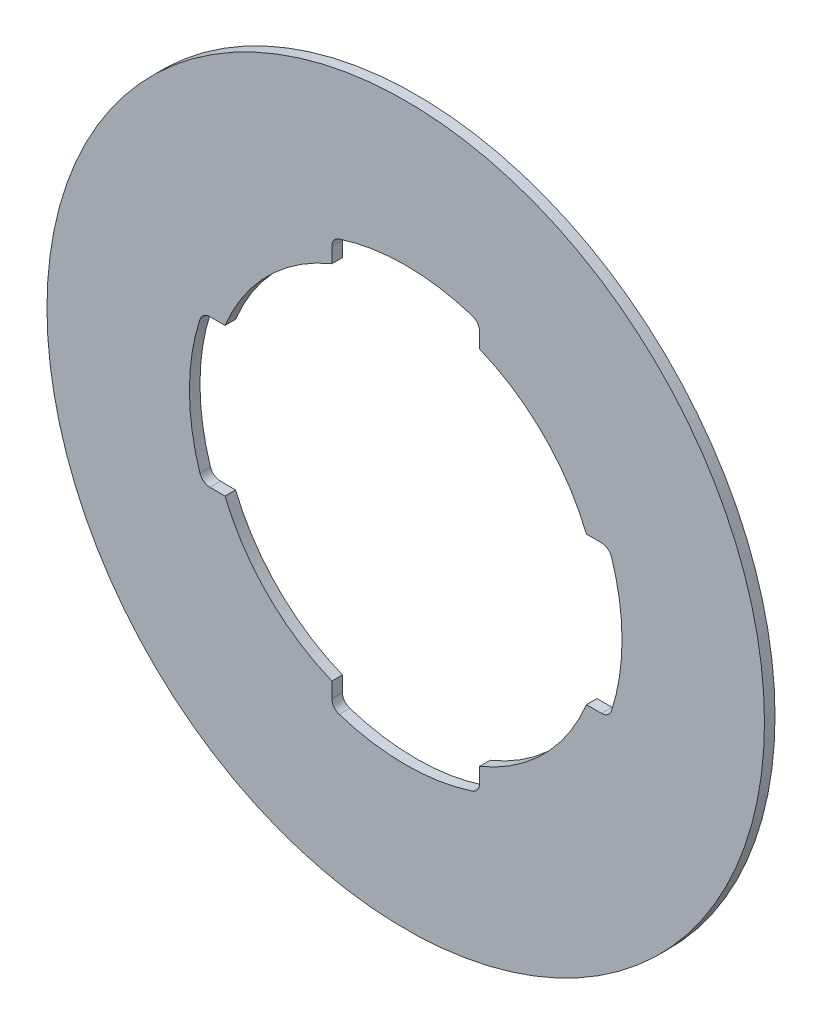
ISO-10303-21;
HEADER;
FILE_DESCRIPTION(('STEP AP214'),'2;1');
FILE_NAME('part.step','',(''),(''),'','','');
FILE_SCHEMA(('AUTOMOTIVE_DESIGN { 1 0 10303 214 1 1 1 1 }'));
ENDSEC;
DATA;
#1=APPLICATION_CONTEXT('core data for automotive mechanical design processes');
#2=APPLICATION_PROTOCOL_DEFINITION('international standard','automotive_design',2000,#1);
#3=PRODUCT_CONTEXT('',#1,'mechanical');
#4=PRODUCT('Part','Part','',(#3));
#5=PRODUCT_RELATED_PRODUCT_CATEGORY('part','',(#4));
#6=PRODUCT_DEFINITION_FORMATION('','',#4);
#7=PRODUCT_DEFINITION_CONTEXT('part definition',#1,'design');
#8=PRODUCT_DEFINITION('design','',#6,#7);
#9=PRODUCT_DEFINITION_SHAPE('','',#8);
#10=(LENGTH_UNIT() NAMED_UNIT(*) SI_UNIT(.MILLI.,.METRE.));
#11=(NAMED_UNIT(*) PLANE_ANGLE_UNIT() SI_UNIT($,.RADIAN.));
#12=(NAMED_UNIT(*) SI_UNIT($,.STERADIAN.) SOLID_ANGLE_UNIT());
#13=UNCERTAINTY_MEASURE_WITH_UNIT(LENGTH_MEASURE(1.E-05),#10,'distance_accuracy_value','');
#14=(GEOMETRIC_REPRESENTATION_CONTEXT(3) GLOBAL_UNCERTAINTY_ASSIGNED_CONTEXT((#13)) GLOBAL_UNIT_ASSIGNED_CONTEXT((#10,
#11,#12)) REPRESENTATION_CONTEXT('',''));
#15=CARTESIAN_POINT('',(0.,0.,0.));
#16=DIRECTION('',(0.,0.,1.));
#17=DIRECTION('',(1.,0.,0.));
#18=AXIS2_PLACEMENT_3D('',#15,#16,#17);
#19=CARTESIAN_POINT('',(0.,0.,0.));
#20=DIRECTION('',(0.,0.,1.));
#21=DIRECTION('',(1.,0.,0.));
#22=AXIS2_PLACEMENT_3D('',#19,#20,#21);
#23=PLANE('',#22);
#24=CARTESIAN_POINT('',(0.,0.,0.));
#25=DIRECTION('',(0.,0.,1.));
#26=DIRECTION('',(-1.,0.,0.));
#27=AXIS2_PLACEMENT_3D('',#24,#25,#26);
#28=CIRCLE('',#27,17.);
#29=CARTESIAN_POINT('',(-17.,0.,0.));
#30=VERTEX_POINT('',#29);
#31=EDGE_CURVE('E294',#30,#30,#28,.T.);
#32=ORIENTED_EDGE('',*,*,#31,.F.);
#33=EDGE_LOOP('',(#32));
#34=FACE_BOUND('',#33,.T.);
#35=CARTESIAN_POINT('',(-3.,9.27698765764,0.));
#36=DIRECTION('',(0.,0.,1.));
#37=DIRECTION('',(-0.307692307692293,0.95148591360408,0.));
#38=AXIS2_PLACEMENT_3D('',#35,#36,#37);
#39=CIRCLE('',#38,0.5);
#40=CARTESIAN_POINT('',(-3.153846153846,9.752730614442,0.));
#41=VERTEX_POINT('',#40);
#42=CARTESIAN_POINT('',(-3.5,9.27698765764,0.));
#43=VERTEX_POINT('',#42);
#44=EDGE_CURVE('E11',#41,#43,#39,.T.);
#45=ORIENTED_EDGE('',*,*,#44,.T.);
#46=DIRECTION('',(0.,1.,0.));
#47=VECTOR('',#46,1.);
#48=CARTESIAN_POINT('',(-3.5,8.562271894772,0.));
#49=LINE('',#48,#47);
#50=CARTESIAN_POINT('',(-3.5,8.562271894772,0.));
#51=VERTEX_POINT('',#50);
#52=EDGE_CURVE('E36',#51,#43,#49,.T.);
#53=ORIENTED_EDGE('',*,*,#52,.F.);
#54=CARTESIAN_POINT('',(0.,0.,0.));
#55=DIRECTION('',(0.,0.,-1.));
#56=DIRECTION('',(-0.925651015651002,0.378378378378401,0.));
#57=AXIS2_PLACEMENT_3D('',#54,#55,#56);
#58=CIRCLE('',#57,9.25);
#59=CARTESIAN_POINT('',(-8.562271894772,3.5,0.));
#60=VERTEX_POINT('',#59);
#61=EDGE_CURVE('E214',#60,#51,#58,.T.);
#62=ORIENTED_EDGE('',*,*,#61,.F.);
#63=DIRECTION('',(1.,0.,0.));
#64=VECTOR('',#63,1.);
#65=CARTESIAN_POINT('',(-9.27698765764,3.5,0.));
#66=LINE('',#65,#64);
#67=CARTESIAN_POINT('',(-9.27698765764,3.5,0.));
#68=VERTEX_POINT('',#67);
#69=EDGE_CURVE('E222',#68,#60,#66,.T.);
#70=ORIENTED_EDGE('',*,*,#69,.F.);
#71=CARTESIAN_POINT('',(-9.27698765764,3.,0.));
#72=DIRECTION('',(0.,0.,1.));
#73=DIRECTION('',(0.,1.,0.));
#74=AXIS2_PLACEMENT_3D('',#71,#72,#73);
#75=CIRCLE('',#74,0.5);
#76=CARTESIAN_POINT('',(-9.752730614442,3.153846153846,0.));
#77=VERTEX_POINT('',#76);
#78=EDGE_CURVE('E27',#68,#77,#75,.T.);
#79=ORIENTED_EDGE('',*,*,#78,.T.);
#80=CARTESIAN_POINT('',(0.,0.,0.));
#81=DIRECTION('',(0.,0.,-1.));
#82=DIRECTION('',(-0.95148591360408,-0.307692307692293,0.));
#83=AXIS2_PLACEMENT_3D('',#80,#81,#82);
#84=CIRCLE('',#83,10.25);
#85=CARTESIAN_POINT('',(-9.752730614442,-3.153846153846,0.));
#86=VERTEX_POINT('',#85);
#87=EDGE_CURVE('E229',#86,#77,#84,.T.);
#88=ORIENTED_EDGE('',*,*,#87,.F.);
#89=CARTESIAN_POINT('',(-9.27698765764,-3.,0.));
#90=DIRECTION('',(0.,0.,1.));
#91=DIRECTION('',(-0.95148591360408,-0.307692307692293,0.));
#92=AXIS2_PLACEMENT_3D('',#89,#90,#91);
#93=CIRCLE('',#92,0.5);
#94=CARTESIAN_POINT('',(-9.27698765764,-3.5,0.));
#95=VERTEX_POINT('',#94);
#96=EDGE_CURVE('E423',#86,#95,#93,.T.);
#97=ORIENTED_EDGE('',*,*,#96,.T.);
#98=DIRECTION('',(-1.,0.,0.));
#99=VECTOR('',#98,1.);
#100=CARTESIAN_POINT('',(-8.562271894772,-3.5,0.));
#101=LINE('',#100,#99);
#102=CARTESIAN_POINT('',(-8.562271894772,-3.5,0.));
#103=VERTEX_POINT('',#102);
#104=EDGE_CURVE('E236',#103,#95,#101,.T.);
#105=ORIENTED_EDGE('',*,*,#104,.F.);
#106=CARTESIAN_POINT('',(0.,0.,0.));
#107=DIRECTION('',(0.,0.,-1.));
#108=DIRECTION('',(-0.378378378378401,-0.925651015651002,0.));
#109=AXIS2_PLACEMENT_3D('',#106,#107,#108);
#110=CIRCLE('',#109,9.25);
#111=CARTESIAN_POINT('',(-3.5,-8.562271894772,0.));
#112=VERTEX_POINT('',#111);
#113=EDGE_CURVE('E244',#112,#103,#110,.T.);
#114=ORIENTED_EDGE('',*,*,#113,.F.);
#115=DIRECTION('',(0.,1.,0.));
#116=VECTOR('',#115,1.);
#117=CARTESIAN_POINT('',(-3.5,-9.27698765764,0.));
#118=LINE('',#117,#116);
#119=CARTESIAN_POINT('',(-3.5,-9.27698765764,0.));
#120=VERTEX_POINT('',#119);
#121=EDGE_CURVE('E257',#120,#112,#118,.T.);
#122=ORIENTED_EDGE('',*,*,#121,.F.);
#123=CARTESIAN_POINT('',(-3.,-9.27698765764,0.));
#124=DIRECTION('',(0.,0.,1.));
#125=DIRECTION('',(-1.,0.,0.));
#126=AXIS2_PLACEMENT_3D('',#123,#124,#125);
#127=CIRCLE('',#126,0.5);
#128=CARTESIAN_POINT('',(-3.153846153846,-9.752730614442,0.));
#129=VERTEX_POINT('',#128);
#130=EDGE_CURVE('E407',#120,#129,#127,.T.);
#131=ORIENTED_EDGE('',*,*,#130,.T.);
#132=CARTESIAN_POINT('',(0.,0.,0.));
#133=DIRECTION('',(0.,0.,-1.));
#134=DIRECTION('',(0.307692307692293,-0.95148591360408,0.));
#135=AXIS2_PLACEMENT_3D('',#132,#133,#134);
#136=CIRCLE('',#135,10.25);
#137=CARTESIAN_POINT('',(3.153846153846,-9.752730614442,0.));
#138=VERTEX_POINT('',#137);
#139=EDGE_CURVE('E264',#138,#129,#136,.T.);
#140=ORIENTED_EDGE('',*,*,#139,.F.);
#141=CARTESIAN_POINT('',(3.,-9.27698765764,0.));
#142=DIRECTION('',(0.,0.,1.));
#143=DIRECTION('',(0.307692307692293,-0.95148591360408,0.));
#144=AXIS2_PLACEMENT_3D('',#141,#142,#143);
#145=CIRCLE('',#144,0.5);
#146=CARTESIAN_POINT('',(3.5,-9.27698765764,0.));
#147=VERTEX_POINT('',#146);
#148=EDGE_CURVE('E397',#138,#147,#145,.T.);
#149=ORIENTED_EDGE('',*,*,#148,.T.);
#150=DIRECTION('',(0.,-1.,0.));
#151=VECTOR('',#150,1.);
#152=CARTESIAN_POINT('',(3.5,-8.562271894772,0.));
#153=LINE('',#152,#151);
#154=CARTESIAN_POINT('',(3.5,-8.562271894772,0.));
#155=VERTEX_POINT('',#154);
#156=EDGE_CURVE('E245',#155,#147,#153,.T.);
#157=ORIENTED_EDGE('',*,*,#156,.F.);
#158=CARTESIAN_POINT('',(0.,0.,0.));
#159=DIRECTION('',(0.,0.,-1.));
#160=DIRECTION('',(0.925651015651002,-0.378378378378401,0.));
#161=AXIS2_PLACEMENT_3D('',#158,#159,#160);
#162=CIRCLE('',#161,9.25);
#163=CARTESIAN_POINT('',(8.562271894772,-3.5,0.));
#164=VERTEX_POINT('',#163);
#165=EDGE_CURVE('E240',#164,#155,#162,.T.);
#166=ORIENTED_EDGE('',*,*,#165,.F.);
#167=DIRECTION('',(-1.,0.,0.));
#168=VECTOR('',#167,1.);
#169=CARTESIAN_POINT('',(9.27698765764,-3.5,0.));
#170=LINE('',#169,#168);
#171=CARTESIAN_POINT('',(9.27698765764,-3.5,0.));
#172=VERTEX_POINT('',#171);
#173=EDGE_CURVE('E249',#172,#164,#170,.T.);
#174=ORIENTED_EDGE('',*,*,#173,.F.);
#175=CARTESIAN_POINT('',(9.27698765764,-3.,0.));
#176=DIRECTION('',(0.,0.,1.));
#177=DIRECTION('',(0.,-1.,0.));
#178=AXIS2_PLACEMENT_3D('',#175,#176,#177);
#179=CIRCLE('',#178,0.5);
#180=CARTESIAN_POINT('',(9.752730614442,-3.153846153846,0.));
#181=VERTEX_POINT('',#180);
#182=EDGE_CURVE('E373',#172,#181,#179,.T.);
#183=ORIENTED_EDGE('',*,*,#182,.T.);
#184=CARTESIAN_POINT('',(0.,0.,0.));
#185=DIRECTION('',(0.,0.,-1.));
#186=DIRECTION('',(0.95148591360408,0.307692307692293,0.));
#187=AXIS2_PLACEMENT_3D('',#184,#185,#186);
#188=CIRCLE('',#187,10.25);
#189=CARTESIAN_POINT('',(9.752730614442,3.153846153846,0.));
#190=VERTEX_POINT('',#189);
#191=EDGE_CURVE('E273',#190,#181,#188,.T.);
#192=ORIENTED_EDGE('',*,*,#191,.F.);
#193=CARTESIAN_POINT('',(9.27698765764,3.,0.));
#194=DIRECTION('',(0.,0.,1.));
#195=DIRECTION('',(0.95148591360408,0.307692307692293,0.));
#196=AXIS2_PLACEMENT_3D('',#193,#194,#195);
#197=CIRCLE('',#196,0.5);
#198=CARTESIAN_POINT('',(9.27698765764,3.5,0.));
#199=VERTEX_POINT('',#198);
#200=EDGE_CURVE('E289',#190,#199,#197,.T.);
#201=ORIENTED_EDGE('',*,*,#200,.T.);
#202=DIRECTION('',(1.,0.,0.));
#203=VECTOR('',#202,1.);
#204=CARTESIAN_POINT('',(8.562271894772,3.5,0.));
#205=LINE('',#204,#203);
#206=CARTESIAN_POINT('',(8.562271894772,3.5,0.));
#207=VERTEX_POINT('',#206);
#208=EDGE_CURVE('E278',#207,#199,#205,.T.);
#209=ORIENTED_EDGE('',*,*,#208,.F.);
#210=CARTESIAN_POINT('',(0.,0.,0.));
#211=DIRECTION('',(0.,0.,-1.));
#212=DIRECTION('',(0.378378378378401,0.925651015651002,0.));
#213=AXIS2_PLACEMENT_3D('',#210,#211,#212);
#214=CIRCLE('',#213,9.25);
#215=CARTESIAN_POINT('',(3.5,8.562271894772,0.));
#216=VERTEX_POINT('',#215);
#217=EDGE_CURVE('E218',#216,#207,#214,.T.);
#218=ORIENTED_EDGE('',*,*,#217,.F.);
#219=DIRECTION('',(0.,-1.,0.));
#220=VECTOR('',#219,1.);
#221=CARTESIAN_POINT('',(3.5,9.27698765764,0.));
#222=LINE('',#221,#220);
#223=CARTESIAN_POINT('',(3.5,9.27698765764,0.));
#224=VERTEX_POINT('',#223);
#225=EDGE_CURVE('E191',#224,#216,#222,.T.);
#226=ORIENTED_EDGE('',*,*,#225,.F.);
#227=CARTESIAN_POINT('',(3.,9.27698765764,0.));
#228=DIRECTION('',(0.,0.,1.));
#229=DIRECTION('',(1.,0.,0.));
#230=AXIS2_PLACEMENT_3D('',#227,#228,#229);
#231=CIRCLE('',#230,0.5);
#232=CARTESIAN_POINT('',(3.153846153846,9.752730614442,0.));
#233=VERTEX_POINT('',#232);
#234=EDGE_CURVE('E201',#224,#233,#231,.T.);
#235=ORIENTED_EDGE('',*,*,#234,.T.);
#236=CARTESIAN_POINT('',(0.,0.,0.));
#237=DIRECTION('',(0.,0.,-1.));
#238=DIRECTION('',(-0.307692307692293,0.95148591360408,0.));
#239=AXIS2_PLACEMENT_3D('',#236,#237,#238);
#240=CIRCLE('',#239,10.25);
#241=EDGE_CURVE('E202',#41,#233,#240,.T.);
#242=ORIENTED_EDGE('',*,*,#241,.F.);
#243=EDGE_LOOP('',(#45,#53,#62,#70,#79,#88,#97,#105,#114,#122,#131,#140,#149,#157,#166,#174,
#183,#192,#201,#209,#218,#226,#235,#242));
#244=FACE_BOUND('',#243,.T.);
#245=ADVANCED_FACE('F17',(#34,#244),#23,.F.);
#246=CARTESIAN_POINT('',(0.,0.,0.));
#247=DIRECTION('',(0.,0.,1.));
#248=DIRECTION('',(1.,0.,0.));
#249=AXIS2_PLACEMENT_3D('',#246,#247,#248);
#250=CYLINDRICAL_SURFACE('',#249,17.);
#251=CARTESIAN_POINT('',(0.,0.,0.5));
#252=DIRECTION('',(0.,0.,1.));
#253=DIRECTION('',(1.,0.,0.));
#254=AXIS2_PLACEMENT_3D('',#251,#252,#253);
#255=CIRCLE('',#254,17.);
#256=CARTESIAN_POINT('',(17.,0.,0.5));
#257=VERTEX_POINT('',#256);
#258=EDGE_CURVE('E296',#257,#257,#255,.T.);
#259=ORIENTED_EDGE('',*,*,#258,.F.);
#260=EDGE_LOOP('',(#259));
#261=FACE_BOUND('',#260,.T.);
#262=ORIENTED_EDGE('',*,*,#31,.T.);
#263=EDGE_LOOP('',(#262));
#264=FACE_BOUND('',#263,.T.);
#265=ADVANCED_FACE('F451',(#261,#264),#250,.T.);
#266=CARTESIAN_POINT('',(0.,0.,0.5));
#267=DIRECTION('',(0.,0.,1.));
#268=DIRECTION('',(1.,0.,0.));
#269=AXIS2_PLACEMENT_3D('',#266,#267,#268);
#270=PLANE('',#269);
#271=ORIENTED_EDGE('',*,*,#258,.T.);
#272=EDGE_LOOP('',(#271));
#273=FACE_BOUND('',#272,.T.);
#274=CARTESIAN_POINT('',(0.,0.,0.5));
#275=DIRECTION('',(0.,0.,-1.));
#276=DIRECTION('',(0.378378378378401,0.925651015651002,0.));
#277=AXIS2_PLACEMENT_3D('',#274,#275,#276);
#278=CIRCLE('',#277,9.25);
#279=CARTESIAN_POINT('',(3.5,8.562271894772,0.5));
#280=VERTEX_POINT('',#279);
#281=CARTESIAN_POINT('',(8.562271894772,3.5,0.5));
#282=VERTEX_POINT('',#281);
#283=EDGE_CURVE('E299',#280,#282,#278,.T.);
#284=ORIENTED_EDGE('',*,*,#283,.T.);
#285=DIRECTION('',(1.,0.,0.));
#286=VECTOR('',#285,1.);
#287=CARTESIAN_POINT('',(8.562271894772,3.5,0.5));
#288=LINE('',#287,#286);
#289=CARTESIAN_POINT('',(9.27698765764,3.5,0.5));
#290=VERTEX_POINT('',#289);
#291=EDGE_CURVE('E301',#282,#290,#288,.T.);
#292=ORIENTED_EDGE('',*,*,#291,.T.);
#293=CARTESIAN_POINT('',(9.27698765764,3.,0.5));
#294=DIRECTION('',(0.,0.,-1.));
#295=DIRECTION('',(0.,1.,0.));
#296=AXIS2_PLACEMENT_3D('',#293,#294,#295);
#297=CIRCLE('',#296,0.5);
#298=CARTESIAN_POINT('',(9.752730614442,3.153846153846,0.5));
#299=VERTEX_POINT('',#298);
#300=EDGE_CURVE('E304',#290,#299,#297,.T.);
#301=ORIENTED_EDGE('',*,*,#300,.T.);
#302=CARTESIAN_POINT('',(0.,0.,0.5));
#303=DIRECTION('',(0.,0.,-1.));
#304=DIRECTION('',(0.95148591360408,0.307692307692293,0.));
#305=AXIS2_PLACEMENT_3D('',#302,#303,#304);
#306=CIRCLE('',#305,10.25);
#307=CARTESIAN_POINT('',(9.752730614442,-3.153846153846,0.5));
#308=VERTEX_POINT('',#307);
#309=EDGE_CURVE('E307',#299,#308,#306,.T.);
#310=ORIENTED_EDGE('',*,*,#309,.T.);
#311=CARTESIAN_POINT('',(9.27698765764,-3.,0.5));
#312=DIRECTION('',(0.,0.,-1.));
#313=DIRECTION('',(0.95148591360408,-0.307692307692293,0.));
#314=AXIS2_PLACEMENT_3D('',#311,#312,#313);
#315=CIRCLE('',#314,0.5);
#316=CARTESIAN_POINT('',(9.27698765764,-3.5,0.5));
#317=VERTEX_POINT('',#316);
#318=EDGE_CURVE('E310',#308,#317,#315,.T.);
#319=ORIENTED_EDGE('',*,*,#318,.T.);
#320=DIRECTION('',(-1.,0.,0.));
#321=VECTOR('',#320,1.);
#322=CARTESIAN_POINT('',(9.27698765764,-3.5,0.5));
#323=LINE('',#322,#321);
#324=CARTESIAN_POINT('',(8.562271894772,-3.5,0.5));
#325=VERTEX_POINT('',#324);
#326=EDGE_CURVE('E313',#317,#325,#323,.T.);
#327=ORIENTED_EDGE('',*,*,#326,.T.);
#328=CARTESIAN_POINT('',(0.,0.,0.5));
#329=DIRECTION('',(0.,0.,-1.));
#330=DIRECTION('',(0.925651015651002,-0.378378378378401,0.));
#331=AXIS2_PLACEMENT_3D('',#328,#329,#330);
#332=CIRCLE('',#331,9.25);
#333=CARTESIAN_POINT('',(3.5,-8.562271894772,0.5));
#334=VERTEX_POINT('',#333);
#335=EDGE_CURVE('E316',#325,#334,#332,.T.);
#336=ORIENTED_EDGE('',*,*,#335,.T.);
#337=DIRECTION('',(0.,-1.,0.));
#338=VECTOR('',#337,1.);
#339=CARTESIAN_POINT('',(3.5,-8.562271894772,0.5));
#340=LINE('',#339,#338);
#341=CARTESIAN_POINT('',(3.5,-9.27698765764,0.5));
#342=VERTEX_POINT('',#341);
#343=EDGE_CURVE('E319',#334,#342,#340,.T.);
#344=ORIENTED_EDGE('',*,*,#343,.T.);
#345=CARTESIAN_POINT('',(3.,-9.27698765764,0.5));
#346=DIRECTION('',(0.,0.,-1.));
#347=DIRECTION('',(1.,0.,0.));
#348=AXIS2_PLACEMENT_3D('',#345,#346,#347);
#349=CIRCLE('',#348,0.5);
#350=CARTESIAN_POINT('',(3.153846153846,-9.752730614442,0.5));
#351=VERTEX_POINT('',#350);
#352=EDGE_CURVE('E322',#342,#351,#349,.T.);
#353=ORIENTED_EDGE('',*,*,#352,.T.);
#354=CARTESIAN_POINT('',(0.,0.,0.5));
#355=DIRECTION('',(0.,0.,-1.));
#356=DIRECTION('',(0.307692307692293,-0.95148591360408,0.));
#357=AXIS2_PLACEMENT_3D('',#354,#355,#356);
#358=CIRCLE('',#357,10.25);
#359=CARTESIAN_POINT('',(-3.153846153846,-9.752730614442,0.5));
#360=VERTEX_POINT('',#359);
#361=EDGE_CURVE('E325',#351,#360,#358,.T.);
#362=ORIENTED_EDGE('',*,*,#361,.T.);
#363=CARTESIAN_POINT('',(-3.,-9.27698765764,0.5));
#364=DIRECTION('',(0.,0.,-1.));
#365=DIRECTION('',(-0.307692307692293,-0.95148591360408,0.));
#366=AXIS2_PLACEMENT_3D('',#363,#364,#365);
#367=CIRCLE('',#366,0.5);
#368=CARTESIAN_POINT('',(-3.5,-9.27698765764,0.5));
#369=VERTEX_POINT('',#368);
#370=EDGE_CURVE('E328',#360,#369,#367,.T.);
#371=ORIENTED_EDGE('',*,*,#370,.T.);
#372=DIRECTION('',(0.,1.,0.));
#373=VECTOR('',#372,1.);
#374=CARTESIAN_POINT('',(-3.5,-9.27698765764,0.5));
#375=LINE('',#374,#373);
#376=CARTESIAN_POINT('',(-3.5,-8.562271894772,0.5));
#377=VERTEX_POINT('',#376);
#378=EDGE_CURVE('E331',#369,#377,#375,.T.);
#379=ORIENTED_EDGE('',*,*,#378,.T.);
#380=CARTESIAN_POINT('',(0.,0.,0.5));
#381=DIRECTION('',(0.,0.,-1.));
#382=DIRECTION('',(-0.378378378378401,-0.925651015651002,0.));
#383=AXIS2_PLACEMENT_3D('',#380,#381,#382);
#384=CIRCLE('',#383,9.25);
#385=CARTESIAN_POINT('',(-8.562271894772,-3.5,0.5));
#386=VERTEX_POINT('',#385);
#387=EDGE_CURVE('E334',#377,#386,#384,.T.);
#388=ORIENTED_EDGE('',*,*,#387,.T.);
#389=DIRECTION('',(-1.,0.,0.));
#390=VECTOR('',#389,1.);
#391=CARTESIAN_POINT('',(-8.562271894772,-3.5,0.5));
#392=LINE('',#391,#390);
#393=CARTESIAN_POINT('',(-9.27698765764,-3.5,0.5));
#394=VERTEX_POINT('',#393);
#395=EDGE_CURVE('E337',#386,#394,#392,.T.);
#396=ORIENTED_EDGE('',*,*,#395,.T.);
#397=CARTESIAN_POINT('',(-9.27698765764,-3.,0.5));
#398=DIRECTION('',(0.,0.,-1.));
#399=DIRECTION('',(0.,-1.,0.));
#400=AXIS2_PLACEMENT_3D('',#397,#398,#399);
#401=CIRCLE('',#400,0.5);
#402=CARTESIAN_POINT('',(-9.752730614442,-3.153846153846,0.5));
#403=VERTEX_POINT('',#402);
#404=EDGE_CURVE('E340',#394,#403,#401,.T.);
#405=ORIENTED_EDGE('',*,*,#404,.T.);
#406=CARTESIAN_POINT('',(0.,0.,0.5));
#407=DIRECTION('',(0.,0.,-1.));
#408=DIRECTION('',(-0.95148591360408,-0.307692307692293,0.));
#409=AXIS2_PLACEMENT_3D('',#406,#407,#408);
#410=CIRCLE('',#409,10.25);
#411=CARTESIAN_POINT('',(-9.752730614442,3.153846153846,0.5));
#412=VERTEX_POINT('',#411);
#413=EDGE_CURVE('E343',#403,#412,#410,.T.);
#414=ORIENTED_EDGE('',*,*,#413,.T.);
#415=CARTESIAN_POINT('',(-9.27698765764,3.,0.5));
#416=DIRECTION('',(0.,0.,-1.));
#417=DIRECTION('',(-0.95148591360408,0.307692307692293,0.));
#418=AXIS2_PLACEMENT_3D('',#415,#416,#417);
#419=CIRCLE('',#418,0.5);
#420=CARTESIAN_POINT('',(-9.27698765764,3.5,0.5));
#421=VERTEX_POINT('',#420);
#422=EDGE_CURVE('E346',#412,#421,#419,.T.);
#423=ORIENTED_EDGE('',*,*,#422,.T.);
#424=DIRECTION('',(1.,0.,0.));
#425=VECTOR('',#424,1.);
#426=CARTESIAN_POINT('',(-9.27698765764,3.5,0.5));
#427=LINE('',#426,#425);
#428=CARTESIAN_POINT('',(-8.562271894772,3.5,0.5));
#429=VERTEX_POINT('',#428);
#430=EDGE_CURVE('E349',#421,#429,#427,.T.);
#431=ORIENTED_EDGE('',*,*,#430,.T.);
#432=CARTESIAN_POINT('',(0.,0.,0.5));
#433=DIRECTION('',(0.,0.,-1.));
#434=DIRECTION('',(-0.925651015651002,0.378378378378401,0.));
#435=AXIS2_PLACEMENT_3D('',#432,#433,#434);
#436=CIRCLE('',#435,9.25);
#437=CARTESIAN_POINT('',(-3.5,8.562271894772,0.5));
#438=VERTEX_POINT('',#437);
#439=EDGE_CURVE('E352',#429,#438,#436,.T.);
#440=ORIENTED_EDGE('',*,*,#439,.T.);
#441=DIRECTION('',(0.,1.,0.));
#442=VECTOR('',#441,1.);
#443=CARTESIAN_POINT('',(-3.5,8.562271894772,0.5));
#444=LINE('',#443,#442);
#445=CARTESIAN_POINT('',(-3.5,9.27698765764,0.5));
#446=VERTEX_POINT('',#445);
#447=EDGE_CURVE('E355',#438,#446,#444,.T.);
#448=ORIENTED_EDGE('',*,*,#447,.T.);
#449=CARTESIAN_POINT('',(-3.,9.27698765764,0.5));
#450=DIRECTION('',(0.,0.,-1.));
#451=DIRECTION('',(-1.,0.,0.));
#452=AXIS2_PLACEMENT_3D('',#449,#450,#451);
#453=CIRCLE('',#452,0.5);
#454=CARTESIAN_POINT('',(-3.153846153846,9.752730614442,0.5));
#455=VERTEX_POINT('',#454);
#456=EDGE_CURVE('E358',#446,#455,#453,.T.);
#457=ORIENTED_EDGE('',*,*,#456,.T.);
#458=CARTESIAN_POINT('',(0.,0.,0.5));
#459=DIRECTION('',(0.,0.,-1.));
#460=DIRECTION('',(-0.307692307692293,0.95148591360408,0.));
#461=AXIS2_PLACEMENT_3D('',#458,#459,#460);
#462=CIRCLE('',#461,10.25);
#463=CARTESIAN_POINT('',(3.153846153846,9.752730614442,0.5));
#464=VERTEX_POINT('',#463);
#465=EDGE_CURVE('E195',#455,#464,#462,.T.);
#466=ORIENTED_EDGE('',*,*,#465,.T.);
#467=CARTESIAN_POINT('',(3.,9.27698765764,0.5));
#468=DIRECTION('',(0.,0.,-1.));
#469=DIRECTION('',(0.307692307692293,0.95148591360408,0.));
#470=AXIS2_PLACEMENT_3D('',#467,#468,#469);
#471=CIRCLE('',#470,0.5);
#472=CARTESIAN_POINT('',(3.5,9.27698765764,0.5));
#473=VERTEX_POINT('',#472);
#474=EDGE_CURVE('E176',#464,#473,#471,.T.);
#475=ORIENTED_EDGE('',*,*,#474,.T.);
#476=DIRECTION('',(0.,-1.,0.));
#477=VECTOR('',#476,1.);
#478=CARTESIAN_POINT('',(3.5,9.27698765764,0.5));
#479=LINE('',#478,#477);
#480=EDGE_CURVE('E182',#473,#280,#479,.T.);
#481=ORIENTED_EDGE('',*,*,#480,.T.);
#482=EDGE_LOOP('',(#284,#292,#301,#310,#319,#327,#336,#344,#353,#362,#371,#379,#388,#396,#405,
#414,#423,#431,#440,#448,#457,#466,#475,#481));
#483=FACE_BOUND('',#482,.T.);
#484=ADVANCED_FACE('F193',(#273,#483),#270,.T.);
#485=CARTESIAN_POINT('',(3.5,9.633924433999,0.));
#486=DIRECTION('',(1.,0.,0.));
#487=DIRECTION('',(0.,-1.,0.));
#488=AXIS2_PLACEMENT_3D('',#485,#486,#487);
#489=PLANE('',#488);
#490=ORIENTED_EDGE('',*,*,#225,.T.);
#491=DIRECTION('',(0.,0.,1.));
#492=VECTOR('',#491,1.);
#493=CARTESIAN_POINT('',(3.5,8.562271894772,0.));
#494=LINE('',#493,#492);
#495=EDGE_CURVE('E187',#216,#280,#494,.T.);
#496=ORIENTED_EDGE('',*,*,#495,.T.);
#497=ORIENTED_EDGE('',*,*,#480,.F.);
#498=DIRECTION('',(0.,0.,1.));
#499=VECTOR('',#498,1.);
#500=CARTESIAN_POINT('',(3.5,9.27698765764,0.));
#501=LINE('',#500,#499);
#502=EDGE_CURVE('E185',#224,#473,#501,.T.);
#503=ORIENTED_EDGE('',*,*,#502,.F.);
#504=EDGE_LOOP('',(#490,#496,#497,#503));
#505=FACE_BOUND('',#504,.T.);
#506=ADVANCED_FACE('F184',(#505),#489,.F.);
#507=CARTESIAN_POINT('',(3.,9.27698765764,-0.6518));
#508=DIRECTION('',(0.,0.,1.));
#509=DIRECTION('',(1.,0.,0.));
#510=AXIS2_PLACEMENT_3D('',#507,#508,#509);
#511=CYLINDRICAL_SURFACE('',#510,0.5);
#512=ORIENTED_EDGE('',*,*,#474,.F.);
#513=DIRECTION('',(0.,0.,1.));
#514=VECTOR('',#513,1.);
#515=CARTESIAN_POINT('',(3.153846153846,9.752730614442,0.));
#516=LINE('',#515,#514);
#517=EDGE_CURVE('E205',#233,#464,#516,.T.);
#518=ORIENTED_EDGE('',*,*,#517,.F.);
#519=ORIENTED_EDGE('',*,*,#234,.F.);
#520=ORIENTED_EDGE('',*,*,#502,.T.);
#521=EDGE_LOOP('',(#512,#518,#519,#520));
#522=FACE_BOUND('',#521,.T.);
#523=ADVANCED_FACE('F199',(#522),#511,.F.);
#524=CARTESIAN_POINT('',(0.,0.,0.));
#525=DIRECTION('',(0.,0.,-1.));
#526=DIRECTION('',(-1.,0.,0.));
#527=AXIS2_PLACEMENT_3D('',#524,#525,#526);
#528=CYLINDRICAL_SURFACE('',#527,10.25);
#529=ORIENTED_EDGE('',*,*,#241,.T.);
#530=ORIENTED_EDGE('',*,*,#517,.T.);
#531=ORIENTED_EDGE('',*,*,#465,.F.);
#532=DIRECTION('',(0.,0.,1.));
#533=VECTOR('',#532,1.);
#534=CARTESIAN_POINT('',(-3.153846153846,9.752730614442,0.));
#535=LINE('',#534,#533);
#536=EDGE_CURVE('E209',#41,#455,#535,.T.);
#537=ORIENTED_EDGE('',*,*,#536,.F.);
#538=EDGE_LOOP('',(#529,#530,#531,#537));
#539=FACE_BOUND('',#538,.T.);
#540=ADVANCED_FACE('F366',(#539),#528,.F.);
#541=CARTESIAN_POINT('',(-3.,9.27698765764,-0.6518));
#542=DIRECTION('',(0.,0.,1.));
#543=DIRECTION('',(-0.307692307692293,0.95148591360408,0.));
#544=AXIS2_PLACEMENT_3D('',#541,#542,#543);
#545=CYLINDRICAL_SURFACE('',#544,0.5);
#546=ORIENTED_EDGE('',*,*,#456,.F.);
#547=DIRECTION('',(0.,0.,1.));
#548=VECTOR('',#547,1.);
#549=CARTESIAN_POINT('',(-3.5,9.27698765764,0.));
#550=LINE('',#549,#548);
#551=EDGE_CURVE('E212',#43,#446,#550,.T.);
#552=ORIENTED_EDGE('',*,*,#551,.F.);
#553=ORIENTED_EDGE('',*,*,#44,.F.);
#554=ORIENTED_EDGE('',*,*,#536,.T.);
#555=EDGE_LOOP('',(#546,#552,#553,#554));
#556=FACE_BOUND('',#555,.T.);
#557=ADVANCED_FACE('F364',(#556),#545,.F.);
#558=CARTESIAN_POINT('',(-3.5,8.562271894772,0.));
#559=DIRECTION('',(-1.,0.,0.));
#560=DIRECTION('',(0.,1.,0.));
#561=AXIS2_PLACEMENT_3D('',#558,#559,#560);
#562=PLANE('',#561);
#563=ORIENTED_EDGE('',*,*,#447,.F.);
#564=DIRECTION('',(0.,0.,1.));
#565=VECTOR('',#564,1.);
#566=CARTESIAN_POINT('',(-3.5,8.562271894772,0.));
#567=LINE('',#566,#565);
#568=EDGE_CURVE('E215',#51,#438,#567,.T.);
#569=ORIENTED_EDGE('',*,*,#568,.F.);
#570=ORIENTED_EDGE('',*,*,#52,.T.);
#571=ORIENTED_EDGE('',*,*,#551,.T.);
#572=EDGE_LOOP('',(#563,#569,#570,#571));
#573=FACE_BOUND('',#572,.T.);
#574=ADVANCED_FACE('F439',(#573),#562,.F.);
#575=CARTESIAN_POINT('',(0.,0.,0.));
#576=DIRECTION('',(0.,0.,1.));
#577=DIRECTION('',(1.,0.,0.));
#578=AXIS2_PLACEMENT_3D('',#575,#576,#577);
#579=CYLINDRICAL_SURFACE('',#578,9.25);
#580=ORIENTED_EDGE('',*,*,#61,.T.);
#581=ORIENTED_EDGE('',*,*,#568,.T.);
#582=ORIENTED_EDGE('',*,*,#439,.F.);
#583=DIRECTION('',(0.,0.,1.));
#584=VECTOR('',#583,1.);
#585=CARTESIAN_POINT('',(-8.562271894772,3.5,0.));
#586=LINE('',#585,#584);
#587=EDGE_CURVE('E219',#60,#429,#586,.T.);
#588=ORIENTED_EDGE('',*,*,#587,.F.);
#589=EDGE_LOOP('',(#580,#581,#582,#588));
#590=FACE_BOUND('',#589,.T.);
#591=ADVANCED_FACE('F438',(#590),#579,.F.);
#592=CARTESIAN_POINT('',(0.,0.,0.));
#593=DIRECTION('',(0.,0.,1.));
#594=DIRECTION('',(1.,0.,0.));
#595=AXIS2_PLACEMENT_3D('',#592,#593,#594);
#596=CYLINDRICAL_SURFACE('',#595,9.25);
#597=ORIENTED_EDGE('',*,*,#283,.F.);
#598=ORIENTED_EDGE('',*,*,#495,.F.);
#599=ORIENTED_EDGE('',*,*,#217,.T.);
#600=DIRECTION('',(0.,0.,1.));
#601=VECTOR('',#600,1.);
#602=CARTESIAN_POINT('',(8.562271894772,3.5,0.));
#603=LINE('',#602,#601);
#604=EDGE_CURVE('E224',#207,#282,#603,.T.);
#605=ORIENTED_EDGE('',*,*,#604,.T.);
#606=EDGE_LOOP('',(#597,#598,#599,#605));
#607=FACE_BOUND('',#606,.T.);
#608=ADVANCED_FACE('F370',(#607),#596,.F.);
#609=CARTESIAN_POINT('',(-9.633924433999,3.5,0.));
#610=DIRECTION('',(0.,1.,0.));
#611=DIRECTION('',(1.,0.,0.));
#612=AXIS2_PLACEMENT_3D('',#609,#610,#611);
#613=PLANE('',#612);
#614=ORIENTED_EDGE('',*,*,#69,.T.);
#615=ORIENTED_EDGE('',*,*,#587,.T.);
#616=ORIENTED_EDGE('',*,*,#430,.F.);
#617=DIRECTION('',(0.,0.,1.));
#618=VECTOR('',#617,1.);
#619=CARTESIAN_POINT('',(-9.27698765764,3.5,0.));
#620=LINE('',#619,#618);
#621=EDGE_CURVE('E223',#68,#421,#620,.T.);
#622=ORIENTED_EDGE('',*,*,#621,.F.);
#623=EDGE_LOOP('',(#614,#615,#616,#622));
#624=FACE_BOUND('',#623,.T.);
#625=ADVANCED_FACE('F434',(#624),#613,.F.);
#626=CARTESIAN_POINT('',(-9.27698765764,3.,-0.6518));
#627=DIRECTION('',(0.,0.,1.));
#628=DIRECTION('',(0.,1.,0.));
#629=AXIS2_PLACEMENT_3D('',#626,#627,#628);
#630=CYLINDRICAL_SURFACE('',#629,0.5);
#631=ORIENTED_EDGE('',*,*,#422,.F.);
#632=DIRECTION('',(0.,0.,1.));
#633=VECTOR('',#632,1.);
#634=CARTESIAN_POINT('',(-9.752730614442,3.153846153846,0.));
#635=LINE('',#634,#633);
#636=EDGE_CURVE('E230',#77,#412,#635,.T.);
#637=ORIENTED_EDGE('',*,*,#636,.F.);
#638=ORIENTED_EDGE('',*,*,#78,.F.);
#639=ORIENTED_EDGE('',*,*,#621,.T.);
#640=EDGE_LOOP('',(#631,#637,#638,#639));
#641=FACE_BOUND('',#640,.T.);
#642=ADVANCED_FACE('F432',(#641),#630,.F.);
#643=CARTESIAN_POINT('',(0.,0.,0.));
#644=DIRECTION('',(0.,0.,-1.));
#645=DIRECTION('',(-1.,0.,0.));
#646=AXIS2_PLACEMENT_3D('',#643,#644,#645);
#647=CYLINDRICAL_SURFACE('',#646,10.25);
#648=ORIENTED_EDGE('',*,*,#87,.T.);
#649=ORIENTED_EDGE('',*,*,#636,.T.);
#650=ORIENTED_EDGE('',*,*,#413,.F.);
#651=DIRECTION('',(0.,0.,1.));
#652=VECTOR('',#651,1.);
#653=CARTESIAN_POINT('',(-9.752730614442,-3.153846153846,0.));
#654=LINE('',#653,#652);
#655=EDGE_CURVE('E233',#86,#403,#654,.T.);
#656=ORIENTED_EDGE('',*,*,#655,.F.);
#657=EDGE_LOOP('',(#648,#649,#650,#656));
#658=FACE_BOUND('',#657,.T.);
#659=ADVANCED_FACE('F426',(#658),#647,.F.);
#660=CARTESIAN_POINT('',(-9.27698765764,-3.,-0.6518));
#661=DIRECTION('',(0.,0.,1.));
#662=DIRECTION('',(-0.95148591360408,-0.307692307692293,0.));
#663=AXIS2_PLACEMENT_3D('',#660,#661,#662);
#664=CYLINDRICAL_SURFACE('',#663,0.5);
#665=ORIENTED_EDGE('',*,*,#404,.F.);
#666=DIRECTION('',(0.,0.,1.));
#667=VECTOR('',#666,1.);
#668=CARTESIAN_POINT('',(-9.27698765764,-3.5,0.));
#669=LINE('',#668,#667);
#670=EDGE_CURVE('E237',#95,#394,#669,.T.);
#671=ORIENTED_EDGE('',*,*,#670,.F.);
#672=ORIENTED_EDGE('',*,*,#96,.F.);
#673=ORIENTED_EDGE('',*,*,#655,.T.);
#674=EDGE_LOOP('',(#665,#671,#672,#673));
#675=FACE_BOUND('',#674,.T.);
#676=ADVANCED_FACE('F422',(#675),#664,.F.);
#677=CARTESIAN_POINT('',(-8.562271894772,-3.5,0.));
#678=DIRECTION('',(0.,-1.,0.));
#679=DIRECTION('',(-1.,0.,0.));
#680=AXIS2_PLACEMENT_3D('',#677,#678,#679);
#681=PLANE('',#680);
#682=ORIENTED_EDGE('',*,*,#395,.F.);
#683=DIRECTION('',(0.,0.,1.));
#684=VECTOR('',#683,1.);
#685=CARTESIAN_POINT('',(-8.562271894772,-3.5,0.));
#686=LINE('',#685,#684);
#687=EDGE_CURVE('E241',#103,#386,#686,.T.);
#688=ORIENTED_EDGE('',*,*,#687,.F.);
#689=ORIENTED_EDGE('',*,*,#104,.T.);
#690=ORIENTED_EDGE('',*,*,#670,.T.);
#691=EDGE_LOOP('',(#682,#688,#689,#690));
#692=FACE_BOUND('',#691,.T.);
#693=ADVANCED_FACE('F418',(#692),#681,.F.);
#694=CARTESIAN_POINT('',(0.,0.,0.));
#695=DIRECTION('',(0.,0.,1.));
#696=DIRECTION('',(1.,0.,0.));
#697=AXIS2_PLACEMENT_3D('',#694,#695,#696);
#698=CYLINDRICAL_SURFACE('',#697,9.25);
#699=ORIENTED_EDGE('',*,*,#335,.F.);
#700=DIRECTION('',(0.,0.,1.));
#701=VECTOR('',#700,1.);
#702=CARTESIAN_POINT('',(8.562271894772,-3.5,0.));
#703=LINE('',#702,#701);
#704=EDGE_CURVE('E246',#164,#325,#703,.T.);
#705=ORIENTED_EDGE('',*,*,#704,.F.);
#706=ORIENTED_EDGE('',*,*,#165,.T.);
#707=DIRECTION('',(0.,0.,1.));
#708=VECTOR('',#707,1.);
#709=CARTESIAN_POINT('',(3.5,-8.562271894772,0.));
#710=LINE('',#709,#708);
#711=EDGE_CURVE('E251',#155,#334,#710,.T.);
#712=ORIENTED_EDGE('',*,*,#711,.T.);
#713=EDGE_LOOP('',(#699,#705,#706,#712));
#714=FACE_BOUND('',#713,.T.);
#715=ADVANCED_FACE('F388',(#714),#698,.F.);
#716=CARTESIAN_POINT('',(0.,0.,0.));
#717=DIRECTION('',(0.,0.,1.));
#718=DIRECTION('',(1.,0.,0.));
#719=AXIS2_PLACEMENT_3D('',#716,#717,#718);
#720=CYLINDRICAL_SURFACE('',#719,9.25);
#721=ORIENTED_EDGE('',*,*,#113,.T.);
#722=ORIENTED_EDGE('',*,*,#687,.T.);
#723=ORIENTED_EDGE('',*,*,#387,.F.);
#724=DIRECTION('',(0.,0.,1.));
#725=VECTOR('',#724,1.);
#726=CARTESIAN_POINT('',(-3.5,-8.562271894772,0.));
#727=LINE('',#726,#725);
#728=EDGE_CURVE('E254',#112,#377,#727,.T.);
#729=ORIENTED_EDGE('',*,*,#728,.F.);
#730=EDGE_LOOP('',(#721,#722,#723,#729));
#731=FACE_BOUND('',#730,.T.);
#732=ADVANCED_FACE('F413',(#731),#720,.F.);
#733=CARTESIAN_POINT('',(3.5,-8.562271894772,0.));
#734=DIRECTION('',(1.,0.,0.));
#735=DIRECTION('',(0.,-1.,0.));
#736=AXIS2_PLACEMENT_3D('',#733,#734,#735);
#737=PLANE('',#736);
#738=ORIENTED_EDGE('',*,*,#343,.F.);
#739=ORIENTED_EDGE('',*,*,#711,.F.);
#740=ORIENTED_EDGE('',*,*,#156,.T.);
#741=DIRECTION('',(0.,0.,1.));
#742=VECTOR('',#741,1.);
#743=CARTESIAN_POINT('',(3.5,-9.27698765764,0.));
#744=LINE('',#743,#742);
#745=EDGE_CURVE('E258',#147,#342,#744,.T.);
#746=ORIENTED_EDGE('',*,*,#745,.T.);
#747=EDGE_LOOP('',(#738,#739,#740,#746));
#748=FACE_BOUND('',#747,.T.);
#749=ADVANCED_FACE('F392',(#748),#737,.F.);
#750=CARTESIAN_POINT('',(3.,-9.27698765764,-0.6518));
#751=DIRECTION('',(0.,0.,1.));
#752=DIRECTION('',(0.307692307692293,-0.95148591360408,0.));
#753=AXIS2_PLACEMENT_3D('',#750,#751,#752);
#754=CYLINDRICAL_SURFACE('',#753,0.5);
#755=ORIENTED_EDGE('',*,*,#352,.F.);
#756=ORIENTED_EDGE('',*,*,#745,.F.);
#757=ORIENTED_EDGE('',*,*,#148,.F.);
#758=DIRECTION('',(0.,0.,1.));
#759=VECTOR('',#758,1.);
#760=CARTESIAN_POINT('',(3.153846153846,-9.752730614442,0.));
#761=LINE('',#760,#759);
#762=EDGE_CURVE('E261',#138,#351,#761,.T.);
#763=ORIENTED_EDGE('',*,*,#762,.T.);
#764=EDGE_LOOP('',(#755,#756,#757,#763));
#765=FACE_BOUND('',#764,.T.);
#766=ADVANCED_FACE('F396',(#765),#754,.F.);
#767=CARTESIAN_POINT('',(0.,0.,0.));
#768=DIRECTION('',(0.,0.,-1.));
#769=DIRECTION('',(-1.,0.,0.));
#770=AXIS2_PLACEMENT_3D('',#767,#768,#769);
#771=CYLINDRICAL_SURFACE('',#770,10.25);
#772=ORIENTED_EDGE('',*,*,#139,.T.);
#773=DIRECTION('',(0.,0.,1.));
#774=VECTOR('',#773,1.);
#775=CARTESIAN_POINT('',(-3.153846153846,-9.752730614442,0.));
#776=LINE('',#775,#774);
#777=EDGE_CURVE('E265',#129,#360,#776,.T.);
#778=ORIENTED_EDGE('',*,*,#777,.T.);
#779=ORIENTED_EDGE('',*,*,#361,.F.);
#780=ORIENTED_EDGE('',*,*,#762,.F.);
#781=EDGE_LOOP('',(#772,#778,#779,#780));
#782=FACE_BOUND('',#781,.T.);
#783=ADVANCED_FACE('F400',(#782),#771,.F.);
#784=CARTESIAN_POINT('',(-3.,-9.27698765764,-0.6518));
#785=DIRECTION('',(0.,0.,1.));
#786=DIRECTION('',(-1.,0.,0.));
#787=AXIS2_PLACEMENT_3D('',#784,#785,#786);
#788=CYLINDRICAL_SURFACE('',#787,0.5);
#789=ORIENTED_EDGE('',*,*,#370,.F.);
#790=ORIENTED_EDGE('',*,*,#777,.F.);
#791=ORIENTED_EDGE('',*,*,#130,.F.);
#792=DIRECTION('',(0.,0.,1.));
#793=VECTOR('',#792,1.);
#794=CARTESIAN_POINT('',(-3.5,-9.27698765764,0.));
#795=LINE('',#794,#793);
#796=EDGE_CURVE('E268',#120,#369,#795,.T.);
#797=ORIENTED_EDGE('',*,*,#796,.T.);
#798=EDGE_LOOP('',(#789,#790,#791,#797));
#799=FACE_BOUND('',#798,.T.);
#800=ADVANCED_FACE('F406',(#799),#788,.F.);
#801=CARTESIAN_POINT('',(-3.5,-9.633924433999,0.));
#802=DIRECTION('',(-1.,0.,0.));
#803=DIRECTION('',(0.,1.,0.));
#804=AXIS2_PLACEMENT_3D('',#801,#802,#803);
#805=PLANE('',#804);
#806=ORIENTED_EDGE('',*,*,#121,.T.);
#807=ORIENTED_EDGE('',*,*,#728,.T.);
#808=ORIENTED_EDGE('',*,*,#378,.F.);
#809=ORIENTED_EDGE('',*,*,#796,.F.);
#810=EDGE_LOOP('',(#806,#807,#808,#809));
#811=FACE_BOUND('',#810,.T.);
#812=ADVANCED_FACE('F409',(#811),#805,.F.);
#813=CARTESIAN_POINT('',(9.633924433999,-3.5,0.));
#814=DIRECTION('',(0.,-1.,0.));
#815=DIRECTION('',(-1.,0.,0.));
#816=AXIS2_PLACEMENT_3D('',#813,#814,#815);
#817=PLANE('',#816);
#818=ORIENTED_EDGE('',*,*,#173,.T.);
#819=ORIENTED_EDGE('',*,*,#704,.T.);
#820=ORIENTED_EDGE('',*,*,#326,.F.);
#821=DIRECTION('',(0.,0.,1.));
#822=VECTOR('',#821,1.);
#823=CARTESIAN_POINT('',(9.27698765764,-3.5,0.));
#824=LINE('',#823,#822);
#825=EDGE_CURVE('E250',#172,#317,#824,.T.);
#826=ORIENTED_EDGE('',*,*,#825,.F.);
#827=EDGE_LOOP('',(#818,#819,#820,#826));
#828=FACE_BOUND('',#827,.T.);
#829=ADVANCED_FACE('F383',(#828),#817,.F.);
#830=CARTESIAN_POINT('',(9.27698765764,-3.,-0.6518));
#831=DIRECTION('',(0.,0.,1.));
#832=DIRECTION('',(0.,-1.,0.));
#833=AXIS2_PLACEMENT_3D('',#830,#831,#832);
#834=CYLINDRICAL_SURFACE('',#833,0.5);
#835=ORIENTED_EDGE('',*,*,#318,.F.);
#836=DIRECTION('',(0.,0.,1.));
#837=VECTOR('',#836,1.);
#838=CARTESIAN_POINT('',(9.752730614442,-3.153846153846,0.));
#839=LINE('',#838,#837);
#840=EDGE_CURVE('E274',#181,#308,#839,.T.);
#841=ORIENTED_EDGE('',*,*,#840,.F.);
#842=ORIENTED_EDGE('',*,*,#182,.F.);
#843=ORIENTED_EDGE('',*,*,#825,.T.);
#844=EDGE_LOOP('',(#835,#841,#842,#843));
#845=FACE_BOUND('',#844,.T.);
#846=ADVANCED_FACE('F381',(#845),#834,.F.);
#847=CARTESIAN_POINT('',(0.,0.,0.));
#848=DIRECTION('',(0.,0.,-1.));
#849=DIRECTION('',(-1.,0.,0.));
#850=AXIS2_PLACEMENT_3D('',#847,#848,#849);
#851=CYLINDRICAL_SURFACE('',#850,10.25);
#852=ORIENTED_EDGE('',*,*,#191,.T.);
#853=ORIENTED_EDGE('',*,*,#840,.T.);
#854=ORIENTED_EDGE('',*,*,#309,.F.);
#855=DIRECTION('',(0.,0.,1.));
#856=VECTOR('',#855,1.);
#857=CARTESIAN_POINT('',(9.752730614442,3.153846153846,0.));
#858=LINE('',#857,#856);
#859=EDGE_CURVE('E276',#190,#299,#858,.T.);
#860=ORIENTED_EDGE('',*,*,#859,.F.);
#861=EDGE_LOOP('',(#852,#853,#854,#860));
#862=FACE_BOUND('',#861,.T.);
#863=ADVANCED_FACE('F375',(#862),#851,.F.);
#864=CARTESIAN_POINT('',(9.27698765764,3.,-0.6518));
#865=DIRECTION('',(0.,0.,1.));
#866=DIRECTION('',(0.95148591360408,0.307692307692293,0.));
#867=AXIS2_PLACEMENT_3D('',#864,#865,#866);
#868=CYLINDRICAL_SURFACE('',#867,0.5);
#869=ORIENTED_EDGE('',*,*,#300,.F.);
#870=DIRECTION('',(0.,0.,1.));
#871=VECTOR('',#870,1.);
#872=CARTESIAN_POINT('',(9.27698765764,3.5,0.));
#873=LINE('',#872,#871);
#874=EDGE_CURVE('E21',#199,#290,#873,.T.);
#875=ORIENTED_EDGE('',*,*,#874,.F.);
#876=ORIENTED_EDGE('',*,*,#200,.F.);
#877=ORIENTED_EDGE('',*,*,#859,.T.);
#878=EDGE_LOOP('',(#869,#875,#876,#877));
#879=FACE_BOUND('',#878,.T.);
#880=ADVANCED_FACE('F372',(#879),#868,.F.);
#881=CARTESIAN_POINT('',(8.562271894772,3.5,0.));
#882=DIRECTION('',(0.,1.,0.));
#883=DIRECTION('',(1.,0.,0.));
#884=AXIS2_PLACEMENT_3D('',#881,#882,#883);
#885=PLANE('',#884);
#886=ORIENTED_EDGE('',*,*,#291,.F.);
#887=ORIENTED_EDGE('',*,*,#604,.F.);
#888=ORIENTED_EDGE('',*,*,#208,.T.);
#889=ORIENTED_EDGE('',*,*,#874,.T.);
#890=EDGE_LOOP('',(#886,#887,#888,#889));
#891=FACE_BOUND('',#890,.T.);
#892=ADVANCED_FACE('F19',(#891),#885,.F.);
#893=CLOSED_SHELL('',(#245,#265,#484,#506,#523,#540,#557,#574,#591,#608,#625,#642,#659,#676,
#693,#715,#732,#749,#766,#783,#800,#812,#829,#846,#863,#880,#892));
#894=MANIFOLD_SOLID_BREP('B1',#893);
#895=ADVANCED_BREP_SHAPE_REPRESENTATION('',(#18,#894),#14);
#896=SHAPE_DEFINITION_REPRESENTATION(#9,#895);
ENDSEC;
END-ISO-10303-21;
